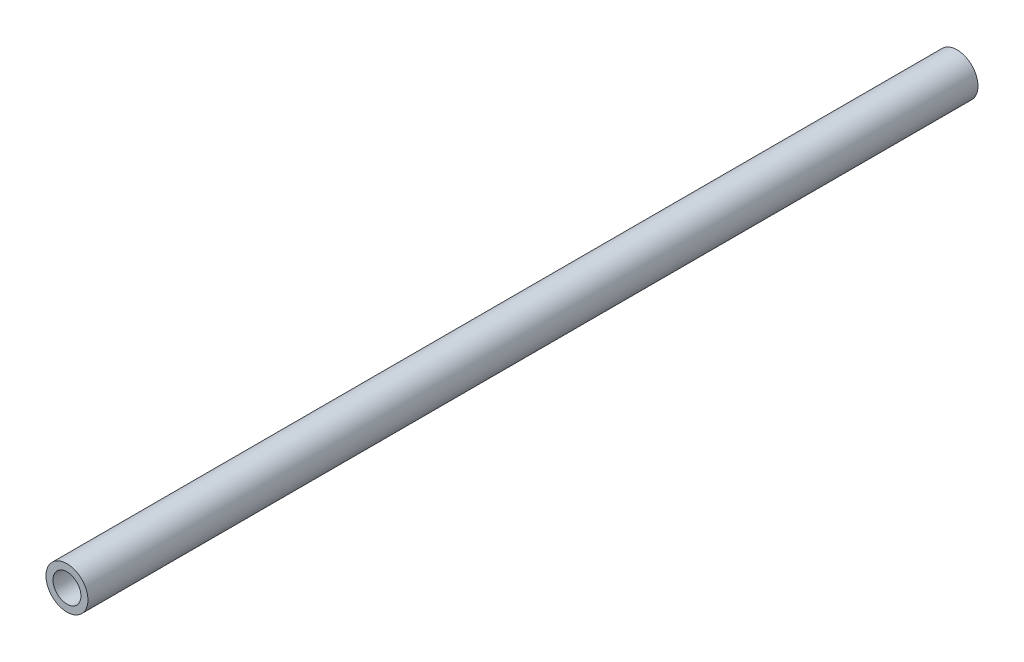
ISO-10303-21;
HEADER;
FILE_DESCRIPTION(('STEP AP214'),'2;1');
FILE_NAME('part.step','',(''),(''),'','','');
FILE_SCHEMA(('AUTOMOTIVE_DESIGN { 1 0 10303 214 1 1 1 1 }'));
ENDSEC;
DATA;
#1=APPLICATION_CONTEXT('core data for automotive mechanical design processes');
#2=APPLICATION_PROTOCOL_DEFINITION('international standard','automotive_design',2000,#1);
#3=PRODUCT_CONTEXT('',#1,'mechanical');
#4=PRODUCT('Part','Part','',(#3));
#5=PRODUCT_RELATED_PRODUCT_CATEGORY('part','',(#4));
#6=PRODUCT_DEFINITION_FORMATION('','',#4);
#7=PRODUCT_DEFINITION_CONTEXT('part definition',#1,'design');
#8=PRODUCT_DEFINITION('design','',#6,#7);
#9=PRODUCT_DEFINITION_SHAPE('','',#8);
#10=(LENGTH_UNIT() NAMED_UNIT(*) SI_UNIT(.MILLI.,.METRE.));
#11=(NAMED_UNIT(*) PLANE_ANGLE_UNIT() SI_UNIT($,.RADIAN.));
#12=(NAMED_UNIT(*) SI_UNIT($,.STERADIAN.) SOLID_ANGLE_UNIT());
#13=UNCERTAINTY_MEASURE_WITH_UNIT(LENGTH_MEASURE(1.E-05),#10,'distance_accuracy_value','');
#14=(GEOMETRIC_REPRESENTATION_CONTEXT(3) GLOBAL_UNCERTAINTY_ASSIGNED_CONTEXT((#13)) GLOBAL_UNIT_ASSIGNED_CONTEXT((#10,
#11,#12)) REPRESENTATION_CONTEXT('',''));
#15=CARTESIAN_POINT('',(0.,0.,0.));
#16=DIRECTION('',(0.,0.,1.));
#17=DIRECTION('',(1.,0.,0.));
#18=AXIS2_PLACEMENT_3D('',#15,#16,#17);
#19=CARTESIAN_POINT('',(0.,0.,127.28));
#20=DIRECTION('',(0.,0.,1.));
#21=DIRECTION('',(1.,0.,0.));
#22=AXIS2_PLACEMENT_3D('',#19,#20,#21);
#23=PLANE('',#22);
#24=CARTESIAN_POINT('',(0.,0.,127.28));
#25=DIRECTION('',(0.,0.,1.));
#26=DIRECTION('',(1.,0.,0.));
#27=AXIS2_PLACEMENT_3D('',#24,#25,#26);
#28=CIRCLE('',#27,3.);
#29=CARTESIAN_POINT('',(3.,0.,127.28));
#30=VERTEX_POINT('',#29);
#31=EDGE_CURVE('E10',#30,#30,#28,.T.);
#32=ORIENTED_EDGE('',*,*,#31,.T.);
#33=EDGE_LOOP('',(#32));
#34=FACE_BOUND('',#33,.T.);
#35=CARTESIAN_POINT('',(0.,0.,127.28));
#36=DIRECTION('',(0.,0.,1.));
#37=DIRECTION('',(1.,0.,0.));
#38=AXIS2_PLACEMENT_3D('',#35,#36,#37);
#39=CIRCLE('',#38,2.);
#40=CARTESIAN_POINT('',(2.,0.,127.28));
#41=VERTEX_POINT('',#40);
#42=EDGE_CURVE('E44',#41,#41,#39,.T.);
#43=ORIENTED_EDGE('',*,*,#42,.F.);
#44=EDGE_LOOP('',(#43));
#45=FACE_BOUND('',#44,.T.);
#46=ADVANCED_FACE('F33',(#34,#45),#23,.T.);
#47=CARTESIAN_POINT('',(0.,0.,0.));
#48=DIRECTION('',(0.,0.,1.));
#49=DIRECTION('',(1.,0.,0.));
#50=AXIS2_PLACEMENT_3D('',#47,#48,#49);
#51=PLANE('',#50);
#52=CARTESIAN_POINT('',(0.,0.,0.));
#53=DIRECTION('',(0.,0.,1.));
#54=DIRECTION('',(1.,0.,0.));
#55=AXIS2_PLACEMENT_3D('',#52,#53,#54);
#56=CIRCLE('',#55,3.);
#57=CARTESIAN_POINT('',(3.,0.,0.));
#58=VERTEX_POINT('',#57);
#59=EDGE_CURVE('E37',#58,#58,#56,.T.);
#60=ORIENTED_EDGE('',*,*,#59,.F.);
#61=EDGE_LOOP('',(#60));
#62=FACE_BOUND('',#61,.T.);
#63=CARTESIAN_POINT('',(0.,0.,0.));
#64=DIRECTION('',(0.,0.,1.));
#65=DIRECTION('',(1.,0.,0.));
#66=AXIS2_PLACEMENT_3D('',#63,#64,#65);
#67=CIRCLE('',#66,2.);
#68=CARTESIAN_POINT('',(2.,0.,0.));
#69=VERTEX_POINT('',#68);
#70=EDGE_CURVE('E46',#69,#69,#67,.T.);
#71=ORIENTED_EDGE('',*,*,#70,.T.);
#72=EDGE_LOOP('',(#71));
#73=FACE_BOUND('',#72,.T.);
#74=ADVANCED_FACE('F56',(#62,#73),#51,.F.);
#75=CARTESIAN_POINT('',(0.,0.,127.28));
#76=DIRECTION('',(0.,0.,-1.));
#77=DIRECTION('',(-1.,0.,0.));
#78=AXIS2_PLACEMENT_3D('',#75,#76,#77);
#79=CYLINDRICAL_SURFACE('',#78,3.);
#80=ORIENTED_EDGE('',*,*,#31,.F.);
#81=EDGE_LOOP('',(#80));
#82=FACE_BOUND('',#81,.T.);
#83=ORIENTED_EDGE('',*,*,#59,.T.);
#84=EDGE_LOOP('',(#83));
#85=FACE_BOUND('',#84,.T.);
#86=ADVANCED_FACE('F35',(#82,#85),#79,.T.);
#87=CARTESIAN_POINT('',(0.,0.,127.28));
#88=DIRECTION('',(0.,0.,-1.));
#89=DIRECTION('',(-1.,0.,0.));
#90=AXIS2_PLACEMENT_3D('',#87,#88,#89);
#91=CYLINDRICAL_SURFACE('',#90,2.);
#92=ORIENTED_EDGE('',*,*,#42,.T.);
#93=EDGE_LOOP('',(#92));
#94=FACE_BOUND('',#93,.T.);
#95=ORIENTED_EDGE('',*,*,#70,.F.);
#96=EDGE_LOOP('',(#95));
#97=FACE_BOUND('',#96,.T.);
#98=ADVANCED_FACE('F52',(#94,#97),#91,.F.);
#99=CLOSED_SHELL('',(#46,#74,#86,#98));
#100=MANIFOLD_SOLID_BREP('B2',#99);
#101=ADVANCED_BREP_SHAPE_REPRESENTATION('',(#18,#100),#14);
#102=SHAPE_DEFINITION_REPRESENTATION(#9,#101);
ENDSEC;
END-ISO-10303-21;
